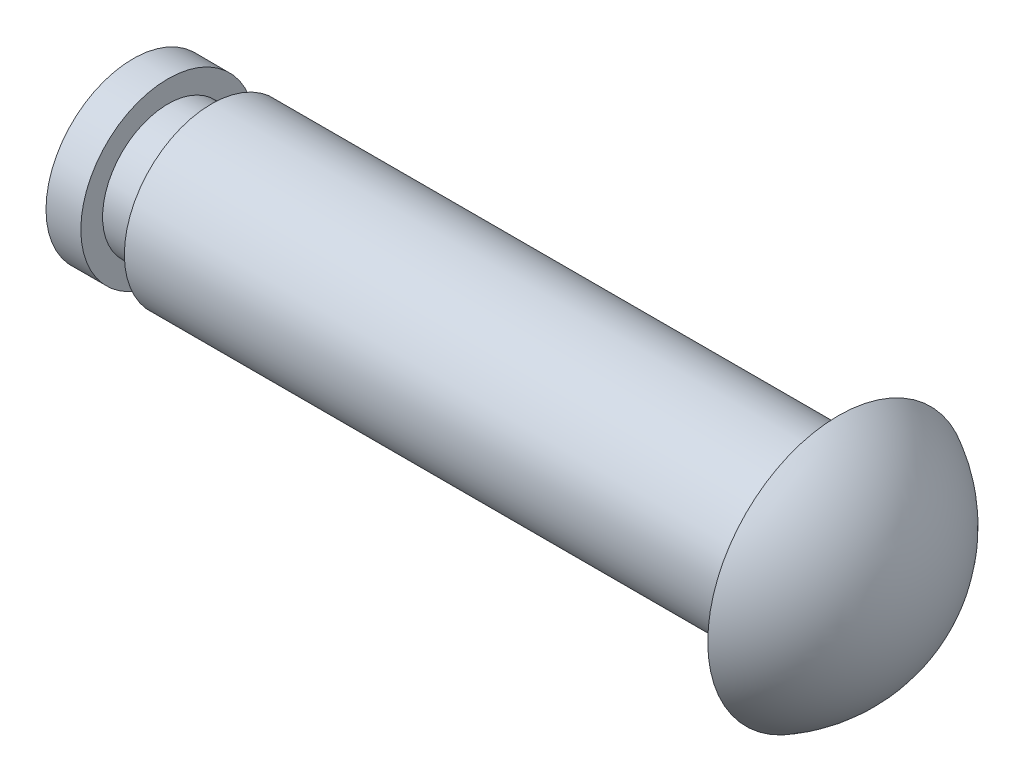
ISO-10303-21;
HEADER;
FILE_DESCRIPTION(('STEP AP214'),'2;1');
FILE_NAME('part.step','',(''),(''),'','','');
FILE_SCHEMA(('AUTOMOTIVE_DESIGN { 1 0 10303 214 1 1 1 1 }'));
ENDSEC;
DATA;
#1=APPLICATION_CONTEXT('core data for automotive mechanical design processes');
#2=APPLICATION_PROTOCOL_DEFINITION('international standard','automotive_design',2000,#1);
#3=PRODUCT_CONTEXT('',#1,'mechanical');
#4=PRODUCT('Part','Part','',(#3));
#5=PRODUCT_RELATED_PRODUCT_CATEGORY('part','',(#4));
#6=PRODUCT_DEFINITION_FORMATION('','',#4);
#7=PRODUCT_DEFINITION_CONTEXT('part definition',#1,'design');
#8=PRODUCT_DEFINITION('design','',#6,#7);
#9=PRODUCT_DEFINITION_SHAPE('','',#8);
#10=(LENGTH_UNIT() NAMED_UNIT(*) SI_UNIT(.MILLI.,.METRE.));
#11=(NAMED_UNIT(*) PLANE_ANGLE_UNIT() SI_UNIT($,.RADIAN.));
#12=(NAMED_UNIT(*) SI_UNIT($,.STERADIAN.) SOLID_ANGLE_UNIT());
#13=UNCERTAINTY_MEASURE_WITH_UNIT(LENGTH_MEASURE(1.E-05),#10,'distance_accuracy_value','');
#14=(GEOMETRIC_REPRESENTATION_CONTEXT(3) GLOBAL_UNCERTAINTY_ASSIGNED_CONTEXT((#13)) GLOBAL_UNIT_ASSIGNED_CONTEXT((#10,
#11,#12)) REPRESENTATION_CONTEXT('',''));
#15=CARTESIAN_POINT('',(0.,0.,0.));
#16=DIRECTION('',(0.,0.,1.));
#17=DIRECTION('',(1.,0.,0.));
#18=AXIS2_PLACEMENT_3D('',#15,#16,#17);
#19=CARTESIAN_POINT('',(0.,0.,0.));
#20=DIRECTION('',(-0.999999999999997,0.,0.));
#21=DIRECTION('',(0.,0.,1.));
#22=AXIS2_PLACEMENT_3D('',#19,#20,#21);
#23=CYLINDRICAL_SURFACE('',#22,4.);
#24=CARTESIAN_POINT('',(3.59999999999999,0.,-1.11022302462516E-13));
#25=DIRECTION('',(0.999999999999997,0.,0.));
#26=DIRECTION('',(0.,0.,-1.));
#27=AXIS2_PLACEMENT_3D('',#24,#25,#26);
#28=CIRCLE('',#27,4.);
#29=CARTESIAN_POINT('',(3.6,0.,-4.00000000000012));
#30=VERTEX_POINT('',#29);
#31=EDGE_CURVE('E91',#30,#30,#28,.T.);
#32=ORIENTED_EDGE('',*,*,#31,.F.);
#33=EDGE_LOOP('',(#32));
#34=FACE_BOUND('',#33,.T.);
#35=CARTESIAN_POINT('',(2.,-1.2490009027033E-13,-3.88578058618805E-13));
#36=DIRECTION('',(-0.999999999999997,0.,0.));
#37=DIRECTION('',(0.,0.,1.));
#38=AXIS2_PLACEMENT_3D('',#35,#36,#37);
#39=CIRCLE('',#38,4.);
#40=CARTESIAN_POINT('',(2.,-1.27342580924505E-13,3.99999999999962));
#41=VERTEX_POINT('',#40);
#42=EDGE_CURVE('E95',#41,#41,#39,.T.);
#43=ORIENTED_EDGE('',*,*,#42,.F.);
#44=EDGE_LOOP('',(#43));
#45=FACE_BOUND('',#44,.T.);
#46=ADVANCED_FACE('F61',(#34,#45),#23,.T.);
#47=CARTESIAN_POINT('',(31.1999999999996,0.,0.));
#48=DIRECTION('',(-0.999999999999997,0.,0.));
#49=DIRECTION('',(0.,0.999999999999999,0.));
#50=AXIS2_PLACEMENT_3D('',#47,#48,#49);
#51=SPHERICAL_SURFACE('',#50,6.8);
#52=CARTESIAN_POINT('',(34.3999999999995,0.,-2.22044604925031E-13));
#53=DIRECTION('',(-0.999999999999997,0.,0.));
#54=DIRECTION('',(0.,0.,1.));
#55=AXIS2_PLACEMENT_3D('',#52,#53,#54);
#56=CIRCLE('',#55,6.);
#57=CARTESIAN_POINT('',(34.3999999999995,0.,5.99999999999979));
#58=VERTEX_POINT('',#57);
#59=EDGE_CURVE('E12',#58,#58,#56,.T.);
#60=ORIENTED_EDGE('',*,*,#59,.F.);
#61=EDGE_LOOP('',(#60));
#62=FACE_BOUND('',#61,.T.);
#63=ADVANCED_FACE('F63',(#62),#51,.T.);
#64=CARTESIAN_POINT('',(34.3999999999996,4.00000000000004,-2.22044604925031E-13));
#65=DIRECTION('',(0.999999999999997,0.,0.));
#66=DIRECTION('',(0.,0.,-1.));
#67=AXIS2_PLACEMENT_3D('',#64,#65,#66);
#68=PLANE('',#67);
#69=CARTESIAN_POINT('',(34.3999999999995,0.,-2.22044604925031E-13));
#70=DIRECTION('',(-0.999999999999997,0.,0.));
#71=DIRECTION('',(0.,0.,1.));
#72=AXIS2_PLACEMENT_3D('',#69,#70,#71);
#73=CIRCLE('',#72,4.);
#74=CARTESIAN_POINT('',(34.3999999999995,0.,3.99999999999979));
#75=VERTEX_POINT('',#74);
#76=EDGE_CURVE('E69',#75,#75,#73,.T.);
#77=ORIENTED_EDGE('',*,*,#76,.F.);
#78=EDGE_LOOP('',(#77));
#79=FACE_BOUND('',#78,.T.);
#80=ORIENTED_EDGE('',*,*,#59,.T.);
#81=EDGE_LOOP('',(#80));
#82=FACE_BOUND('',#81,.T.);
#83=ADVANCED_FACE('F110',(#79,#82),#68,.F.);
#84=CARTESIAN_POINT('',(5.59999999999999,-1.73472347597681E-13,-1.11022302462516E-13));
#85=DIRECTION('',(0.999999999999997,0.,0.));
#86=DIRECTION('',(0.,0.,-1.));
#87=AXIS2_PLACEMENT_3D('',#84,#85,#86);
#88=CIRCLE('',#87,4.);
#89=CARTESIAN_POINT('',(5.6,-1.71029856943505E-13,-4.00000000000012));
#90=VERTEX_POINT('',#89);
#91=EDGE_CURVE('E87',#90,#90,#88,.T.);
#92=ORIENTED_EDGE('',*,*,#91,.T.);
#93=EDGE_LOOP('',(#92));
#94=FACE_BOUND('',#93,.T.);
#95=ORIENTED_EDGE('',*,*,#76,.T.);
#96=EDGE_LOOP('',(#95));
#97=FACE_BOUND('',#96,.T.);
#98=ADVANCED_FACE('F106',(#94,#97),#23,.T.);
#99=CARTESIAN_POINT('',(3.60000000000038,0.,-4.00000000000028));
#100=DIRECTION('',(-0.999999999999997,0.,0.));
#101=DIRECTION('',(0.,0.,1.));
#102=AXIS2_PLACEMENT_3D('',#99,#100,#101);
#103=PLANE('',#102);
#104=CARTESIAN_POINT('',(3.59999999999999,0.,-1.11022302462516E-13));
#105=DIRECTION('',(0.999999999999997,0.,0.));
#106=DIRECTION('',(0.,0.,-1.));
#107=AXIS2_PLACEMENT_3D('',#104,#105,#106);
#108=CIRCLE('',#107,3.);
#109=CARTESIAN_POINT('',(3.59999999999999,0.,-3.00000000000012));
#110=VERTEX_POINT('',#109);
#111=EDGE_CURVE('E75',#110,#110,#108,.T.);
#112=ORIENTED_EDGE('',*,*,#111,.F.);
#113=EDGE_LOOP('',(#112));
#114=FACE_BOUND('',#113,.T.);
#115=ORIENTED_EDGE('',*,*,#31,.T.);
#116=EDGE_LOOP('',(#115));
#117=FACE_BOUND('',#116,.T.);
#118=ADVANCED_FACE('F115',(#114,#117),#103,.F.);
#119=CARTESIAN_POINT('',(34.3999999999995,0.,-2.22044604925031E-13));
#120=DIRECTION('',(0.999999999999997,0.,0.));
#121=DIRECTION('',(0.,0.,-1.));
#122=AXIS2_PLACEMENT_3D('',#119,#120,#121);
#123=CYLINDRICAL_SURFACE('',#122,3.);
#124=CARTESIAN_POINT('',(5.59999999999999,-1.73472347597681E-13,-1.11022302462516E-13));
#125=DIRECTION('',(0.999999999999997,0.,0.));
#126=DIRECTION('',(0.,0.,-1.));
#127=AXIS2_PLACEMENT_3D('',#124,#125,#126);
#128=CIRCLE('',#127,3.);
#129=CARTESIAN_POINT('',(5.6,-1.71640479607049E-13,-3.00000000000012));
#130=VERTEX_POINT('',#129);
#131=EDGE_CURVE('E81',#130,#130,#128,.T.);
#132=ORIENTED_EDGE('',*,*,#131,.F.);
#133=EDGE_LOOP('',(#132));
#134=FACE_BOUND('',#133,.T.);
#135=ORIENTED_EDGE('',*,*,#111,.T.);
#136=EDGE_LOOP('',(#135));
#137=FACE_BOUND('',#136,.T.);
#138=ADVANCED_FACE('F121',(#134,#137),#123,.T.);
#139=CARTESIAN_POINT('',(5.60000000000016,1.87350135405495E-13,-4.00000000000006));
#140=DIRECTION('',(0.999999999999997,0.,0.));
#141=DIRECTION('',(0.,0.,-1.));
#142=AXIS2_PLACEMENT_3D('',#139,#140,#141);
#143=PLANE('',#142);
#144=ORIENTED_EDGE('',*,*,#131,.T.);
#145=EDGE_LOOP('',(#144));
#146=FACE_BOUND('',#145,.T.);
#147=ORIENTED_EDGE('',*,*,#91,.F.);
#148=EDGE_LOOP('',(#147));
#149=FACE_BOUND('',#148,.T.);
#150=ADVANCED_FACE('F126',(#146,#149),#143,.F.);
#151=CARTESIAN_POINT('',(2.,-1.2490009027033E-13,-3.88578058618805E-13));
#152=DIRECTION('',(-0.999999999999997,0.,0.));
#153=DIRECTION('',(0.,0.,1.));
#154=AXIS2_PLACEMENT_3D('',#151,#152,#153);
#155=PLANE('',#154);
#156=ORIENTED_EDGE('',*,*,#42,.T.);
#157=EDGE_LOOP('',(#156));
#158=FACE_BOUND('',#157,.T.);
#159=ADVANCED_FACE('F101',(#158),#155,.T.);
#160=CLOSED_SHELL('',(#46,#63,#83,#98,#118,#138,#150,#159));
#161=MANIFOLD_SOLID_BREP('B2',#160);
#162=ADVANCED_BREP_SHAPE_REPRESENTATION('',(#18,#161),#14);
#163=SHAPE_DEFINITION_REPRESENTATION(#9,#162);
ENDSEC;
END-ISO-10303-21;
